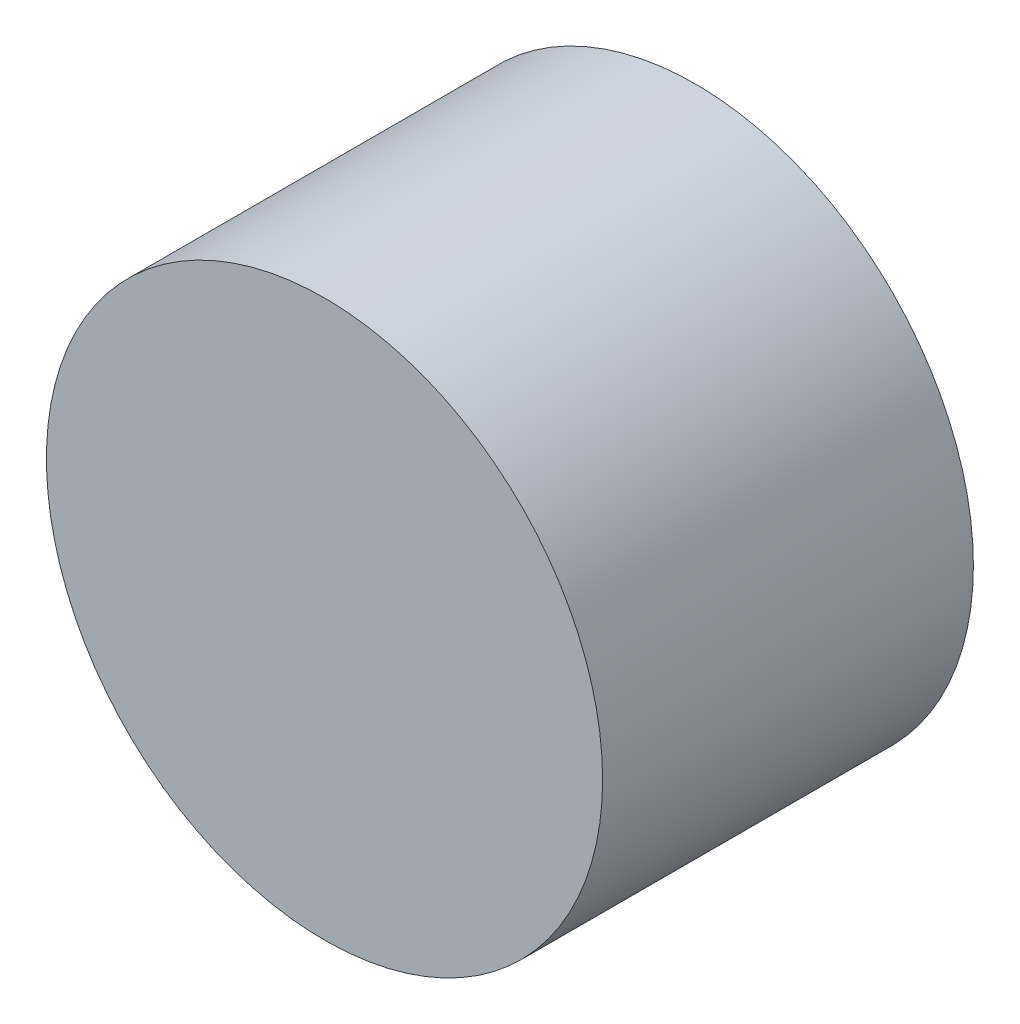
ISO-10303-21;
HEADER;
FILE_DESCRIPTION(('STEP AP214'),'2;1');
FILE_NAME('part.step','',(''),(''),'','','');
FILE_SCHEMA(('AUTOMOTIVE_DESIGN { 1 0 10303 214 1 1 1 1 }'));
ENDSEC;
DATA;
#1=APPLICATION_CONTEXT('core data for automotive mechanical design processes');
#2=APPLICATION_PROTOCOL_DEFINITION('international standard','automotive_design',2000,#1);
#3=PRODUCT_CONTEXT('',#1,'mechanical');
#4=PRODUCT('Part','Part','',(#3));
#5=PRODUCT_RELATED_PRODUCT_CATEGORY('part','',(#4));
#6=PRODUCT_DEFINITION_FORMATION('','',#4);
#7=PRODUCT_DEFINITION_CONTEXT('part definition',#1,'design');
#8=PRODUCT_DEFINITION('design','',#6,#7);
#9=PRODUCT_DEFINITION_SHAPE('','',#8);
#10=(LENGTH_UNIT() NAMED_UNIT(*) SI_UNIT(.MILLI.,.METRE.));
#11=(NAMED_UNIT(*) PLANE_ANGLE_UNIT() SI_UNIT($,.RADIAN.));
#12=(NAMED_UNIT(*) SI_UNIT($,.STERADIAN.) SOLID_ANGLE_UNIT());
#13=UNCERTAINTY_MEASURE_WITH_UNIT(LENGTH_MEASURE(1.E-05),#10,'distance_accuracy_value','');
#14=(GEOMETRIC_REPRESENTATION_CONTEXT(3) GLOBAL_UNCERTAINTY_ASSIGNED_CONTEXT((#13)) GLOBAL_UNIT_ASSIGNED_CONTEXT((#10,
#11,#12)) REPRESENTATION_CONTEXT('',''));
#15=CARTESIAN_POINT('',(0.,0.,0.));
#16=DIRECTION('',(0.,0.,1.));
#17=DIRECTION('',(1.,0.,0.));
#18=AXIS2_PLACEMENT_3D('',#15,#16,#17);
#19=CARTESIAN_POINT('',(0.,0.,10.));
#20=DIRECTION('',(0.,0.,-1.));
#21=DIRECTION('',(-1.,0.,0.));
#22=AXIS2_PLACEMENT_3D('',#19,#20,#21);
#23=CYLINDRICAL_SURFACE('',#22,7.5);
#24=CARTESIAN_POINT('',(0.,0.,10.));
#25=DIRECTION('',(0.,0.,1.));
#26=DIRECTION('',(1.,0.,0.));
#27=AXIS2_PLACEMENT_3D('',#24,#25,#26);
#28=CIRCLE('',#27,7.5);
#29=CARTESIAN_POINT('',(7.5,0.,10.));
#30=VERTEX_POINT('',#29);
#31=EDGE_CURVE('E10',#30,#30,#28,.T.);
#32=ORIENTED_EDGE('',*,*,#31,.F.);
#33=EDGE_LOOP('',(#32));
#34=FACE_BOUND('',#33,.T.);
#35=CARTESIAN_POINT('',(0.,0.,0.));
#36=DIRECTION('',(0.,0.,1.));
#37=DIRECTION('',(1.,0.,0.));
#38=AXIS2_PLACEMENT_3D('',#35,#36,#37);
#39=CIRCLE('',#38,7.5);
#40=CARTESIAN_POINT('',(7.5,0.,0.));
#41=VERTEX_POINT('',#40);
#42=EDGE_CURVE('E34',#41,#41,#39,.T.);
#43=ORIENTED_EDGE('',*,*,#42,.T.);
#44=EDGE_LOOP('',(#43));
#45=FACE_BOUND('',#44,.T.);
#46=ADVANCED_FACE('F31',(#34,#45),#23,.T.);
#47=CARTESIAN_POINT('',(0.,0.,10.));
#48=DIRECTION('',(0.,0.,1.));
#49=DIRECTION('',(1.,0.,0.));
#50=AXIS2_PLACEMENT_3D('',#47,#48,#49);
#51=PLANE('',#50);
#52=ORIENTED_EDGE('',*,*,#31,.T.);
#53=EDGE_LOOP('',(#52));
#54=FACE_BOUND('',#53,.T.);
#55=ADVANCED_FACE('F61',(#54),#51,.T.);
#56=CARTESIAN_POINT('',(0.,0.,0.));
#57=DIRECTION('',(0.,0.,1.));
#58=DIRECTION('',(1.,0.,0.));
#59=AXIS2_PLACEMENT_3D('',#56,#57,#58);
#60=PLANE('',#59);
#61=CARTESIAN_POINT('',(0.,0.,0.));
#62=DIRECTION('',(0.,0.,1.));
#63=DIRECTION('',(1.,0.,0.));
#64=AXIS2_PLACEMENT_3D('',#61,#62,#63);
#65=CIRCLE('',#64,6.25);
#66=CARTESIAN_POINT('',(6.25,0.,0.));
#67=VERTEX_POINT('',#66);
#68=EDGE_CURVE('E43',#67,#67,#65,.T.);
#69=ORIENTED_EDGE('',*,*,#68,.T.);
#70=EDGE_LOOP('',(#69));
#71=FACE_BOUND('',#70,.T.);
#72=ORIENTED_EDGE('',*,*,#42,.F.);
#73=EDGE_LOOP('',(#72));
#74=FACE_BOUND('',#73,.T.);
#75=ADVANCED_FACE('F58',(#71,#74),#60,.F.);
#76=CARTESIAN_POINT('',(0.,0.,8.));
#77=DIRECTION('',(0.,0.,-1.));
#78=DIRECTION('',(-1.,0.,0.));
#79=AXIS2_PLACEMENT_3D('',#76,#77,#78);
#80=CYLINDRICAL_SURFACE('',#79,6.25);
#81=CARTESIAN_POINT('',(0.,0.,8.));
#82=DIRECTION('',(0.,0.,1.));
#83=DIRECTION('',(1.,0.,0.));
#84=AXIS2_PLACEMENT_3D('',#81,#82,#83);
#85=CIRCLE('',#84,6.25);
#86=CARTESIAN_POINT('',(6.25,0.,8.));
#87=VERTEX_POINT('',#86);
#88=EDGE_CURVE('E41',#87,#87,#85,.T.);
#89=ORIENTED_EDGE('',*,*,#88,.T.);
#90=EDGE_LOOP('',(#89));
#91=FACE_BOUND('',#90,.T.);
#92=ORIENTED_EDGE('',*,*,#68,.F.);
#93=EDGE_LOOP('',(#92));
#94=FACE_BOUND('',#93,.T.);
#95=ADVANCED_FACE('F49',(#91,#94),#80,.F.);
#96=CARTESIAN_POINT('',(0.,0.,8.));
#97=DIRECTION('',(0.,0.,1.));
#98=DIRECTION('',(1.,0.,0.));
#99=AXIS2_PLACEMENT_3D('',#96,#97,#98);
#100=PLANE('',#99);
#101=ORIENTED_EDGE('',*,*,#88,.F.);
#102=EDGE_LOOP('',(#101));
#103=FACE_BOUND('',#102,.T.);
#104=ADVANCED_FACE('F52',(#103),#100,.F.);
#105=CLOSED_SHELL('',(#46,#55,#75,#95,#104));
#106=MANIFOLD_SOLID_BREP('B2',#105);
#107=ADVANCED_BREP_SHAPE_REPRESENTATION('',(#18,#106),#14);
#108=SHAPE_DEFINITION_REPRESENTATION(#9,#107);
ENDSEC;
END-ISO-10303-21;
